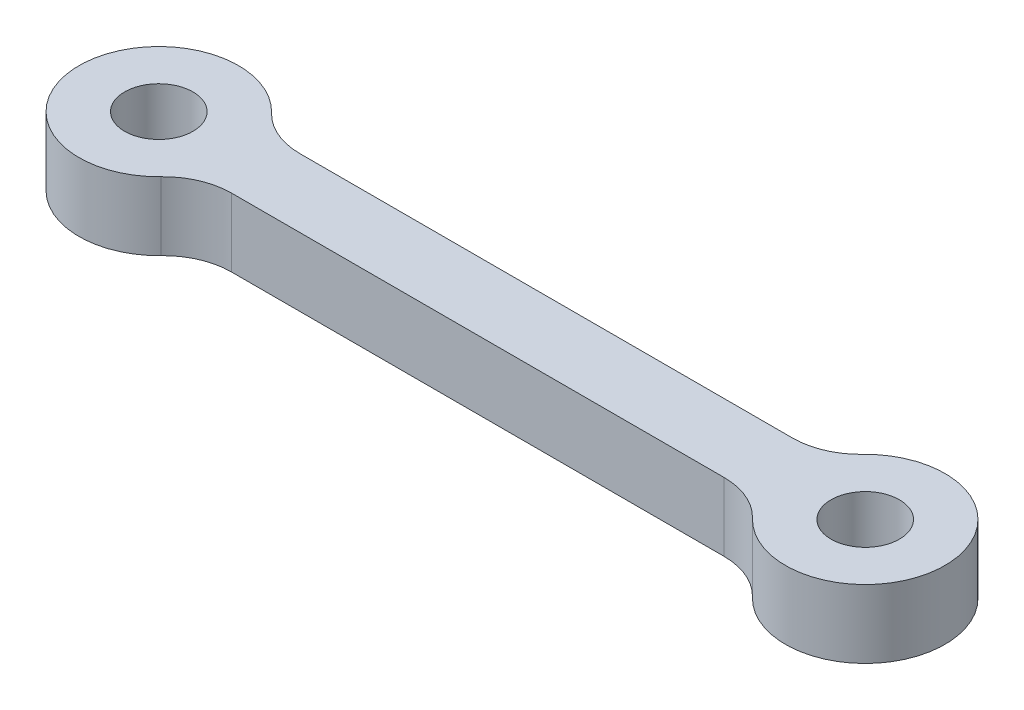
ISO-10303-21;
HEADER;
FILE_DESCRIPTION(('STEP AP214'),'2;1');
FILE_NAME('part.step','',(''),(''),'','','');
FILE_SCHEMA(('AUTOMOTIVE_DESIGN { 1 0 10303 214 1 1 1 1 }'));
ENDSEC;
DATA;
#1=APPLICATION_CONTEXT('core data for automotive mechanical design processes');
#2=APPLICATION_PROTOCOL_DEFINITION('international standard','automotive_design',2000,#1);
#3=PRODUCT_CONTEXT('',#1,'mechanical');
#4=PRODUCT('Part','Part','',(#3));
#5=PRODUCT_RELATED_PRODUCT_CATEGORY('part','',(#4));
#6=PRODUCT_DEFINITION_FORMATION('','',#4);
#7=PRODUCT_DEFINITION_CONTEXT('part definition',#1,'design');
#8=PRODUCT_DEFINITION('design','',#6,#7);
#9=PRODUCT_DEFINITION_SHAPE('','',#8);
#10=(LENGTH_UNIT() NAMED_UNIT(*) SI_UNIT(.MILLI.,.METRE.));
#11=(NAMED_UNIT(*) PLANE_ANGLE_UNIT() SI_UNIT($,.RADIAN.));
#12=(NAMED_UNIT(*) SI_UNIT($,.STERADIAN.) SOLID_ANGLE_UNIT());
#13=UNCERTAINTY_MEASURE_WITH_UNIT(LENGTH_MEASURE(1.E-05),#10,'distance_accuracy_value','');
#14=(GEOMETRIC_REPRESENTATION_CONTEXT(3) GLOBAL_UNCERTAINTY_ASSIGNED_CONTEXT((#13)) GLOBAL_UNIT_ASSIGNED_CONTEXT((#10,
#11,#12)) REPRESENTATION_CONTEXT('',''));
#15=CARTESIAN_POINT('',(0.,0.,0.));
#16=DIRECTION('',(0.,0.,1.));
#17=DIRECTION('',(1.,0.,0.));
#18=AXIS2_PLACEMENT_3D('',#15,#16,#17);
#19=CARTESIAN_POINT('',(-15.5,3.,0.));
#20=DIRECTION('',(0.,1.,0.));
#21=DIRECTION('',(0.,0.,1.));
#22=AXIS2_PLACEMENT_3D('',#19,#20,#21);
#23=PLANE('',#22);
#24=CARTESIAN_POINT('',(-15.5,3.,0.));
#25=DIRECTION('',(0.,1.,0.));
#26=DIRECTION('',(0.,0.,1.));
#27=AXIS2_PLACEMENT_3D('',#24,#25,#26);
#28=CIRCLE('',#27,1.5);
#29=CARTESIAN_POINT('',(-15.5,3.,1.5));
#30=VERTEX_POINT('',#29);
#31=EDGE_CURVE('E190',#30,#30,#28,.T.);
#32=ORIENTED_EDGE('',*,*,#31,.F.);
#33=EDGE_LOOP('',(#32));
#34=FACE_BOUND('',#33,.T.);
#35=DIRECTION('',(-1.,0.,0.));
#36=VECTOR('',#35,1.);
#37=CARTESIAN_POINT('',(-12.3377223398316,3.,-1.5));
#38=LINE('',#37,#36);
#39=CARTESIAN_POINT('',(10.8095842401766,3.,-1.5));
#40=VERTEX_POINT('',#39);
#41=CARTESIAN_POINT('',(-10.8095842401766,3.,-1.5));
#42=VERTEX_POINT('',#41);
#43=EDGE_CURVE('E125',#40,#42,#38,.T.);
#44=ORIENTED_EDGE('',*,*,#43,.T.);
#45=CARTESIAN_POINT('',(-10.8095842401766,3.,-4.5));
#46=DIRECTION('',(0.,1.,0.));
#47=DIRECTION('',(0.,0.,1.));
#48=AXIS2_PLACEMENT_3D('',#45,#46,#47);
#49=CIRCLE('',#48,3.);
#50=CARTESIAN_POINT('',(-12.9743915139412,3.,-2.42307692307692));
#51=VERTEX_POINT('',#50);
#52=EDGE_CURVE('E170',#42,#51,#49,.F.);
#53=ORIENTED_EDGE('',*,*,#52,.T.);
#54=CARTESIAN_POINT('',(-15.5,3.,0.));
#55=DIRECTION('',(0.,1.,0.));
#56=DIRECTION('',(0.,0.,1.));
#57=AXIS2_PLACEMENT_3D('',#54,#55,#56);
#58=CIRCLE('',#57,3.5);
#59=CARTESIAN_POINT('',(-12.9743915139412,3.,2.42307692307692));
#60=VERTEX_POINT('',#59);
#61=EDGE_CURVE('E135',#51,#60,#58,.T.);
#62=ORIENTED_EDGE('',*,*,#61,.T.);
#63=CARTESIAN_POINT('',(-10.8095842401766,3.,4.5));
#64=DIRECTION('',(0.,1.,0.));
#65=DIRECTION('',(0.,0.,1.));
#66=AXIS2_PLACEMENT_3D('',#63,#64,#65);
#67=CIRCLE('',#66,3.);
#68=CARTESIAN_POINT('',(-10.8095842401766,3.,1.5));
#69=VERTEX_POINT('',#68);
#70=EDGE_CURVE('E11',#60,#69,#67,.F.);
#71=ORIENTED_EDGE('',*,*,#70,.T.);
#72=DIRECTION('',(1.,0.,0.));
#73=VECTOR('',#72,1.);
#74=CARTESIAN_POINT('',(-12.3377223398316,3.,1.5));
#75=LINE('',#74,#73);
#76=CARTESIAN_POINT('',(10.8095842401766,3.,1.5));
#77=VERTEX_POINT('',#76);
#78=EDGE_CURVE('E140',#69,#77,#75,.T.);
#79=ORIENTED_EDGE('',*,*,#78,.T.);
#80=CARTESIAN_POINT('',(10.8095842401766,3.,4.5));
#81=DIRECTION('',(0.,1.,0.));
#82=DIRECTION('',(0.,0.,1.));
#83=AXIS2_PLACEMENT_3D('',#80,#81,#82);
#84=CIRCLE('',#83,3.);
#85=CARTESIAN_POINT('',(12.9743915139412,3.,2.42307692307692));
#86=VERTEX_POINT('',#85);
#87=EDGE_CURVE('E176',#77,#86,#84,.F.);
#88=ORIENTED_EDGE('',*,*,#87,.T.);
#89=CARTESIAN_POINT('',(15.5,3.,0.));
#90=DIRECTION('',(0.,1.,0.));
#91=DIRECTION('',(0.,0.,-1.));
#92=AXIS2_PLACEMENT_3D('',#89,#90,#91);
#93=CIRCLE('',#92,3.5);
#94=CARTESIAN_POINT('',(12.9743915139412,3.,-2.42307692307692));
#95=VERTEX_POINT('',#94);
#96=EDGE_CURVE('E195',#86,#95,#93,.T.);
#97=ORIENTED_EDGE('',*,*,#96,.T.);
#98=CARTESIAN_POINT('',(10.8095842401766,3.,-4.5));
#99=DIRECTION('',(0.,1.,0.));
#100=DIRECTION('',(0.,0.,1.));
#101=AXIS2_PLACEMENT_3D('',#98,#99,#100);
#102=CIRCLE('',#101,3.);
#103=EDGE_CURVE('E116',#95,#40,#102,.F.);
#104=ORIENTED_EDGE('',*,*,#103,.T.);
#105=EDGE_LOOP('',(#44,#53,#62,#71,#79,#88,#97,#104));
#106=FACE_BOUND('',#105,.T.);
#107=CARTESIAN_POINT('',(15.5,3.,0.));
#108=DIRECTION('',(0.,1.,0.));
#109=DIRECTION('',(0.,0.,1.));
#110=AXIS2_PLACEMENT_3D('',#107,#108,#109);
#111=CIRCLE('',#110,1.5);
#112=CARTESIAN_POINT('',(15.5,3.,1.5));
#113=VERTEX_POINT('',#112);
#114=EDGE_CURVE('E211',#113,#113,#111,.T.);
#115=ORIENTED_EDGE('',*,*,#114,.F.);
#116=EDGE_LOOP('',(#115));
#117=FACE_BOUND('',#116,.T.);
#118=ADVANCED_FACE('F39',(#34,#106,#117),#23,.T.);
#119=CARTESIAN_POINT('',(-15.5,0.,0.));
#120=DIRECTION('',(0.,1.,0.));
#121=DIRECTION('',(0.,0.,1.));
#122=AXIS2_PLACEMENT_3D('',#119,#120,#121);
#123=PLANE('',#122);
#124=CARTESIAN_POINT('',(-15.5,0.,0.));
#125=DIRECTION('',(0.,1.,0.));
#126=DIRECTION('',(0.,0.,1.));
#127=AXIS2_PLACEMENT_3D('',#124,#125,#126);
#128=CIRCLE('',#127,3.5);
#129=CARTESIAN_POINT('',(-12.9743915139412,0.,-2.42307692307692));
#130=VERTEX_POINT('',#129);
#131=CARTESIAN_POINT('',(-12.9743915139412,0.,2.42307692307692));
#132=VERTEX_POINT('',#131);
#133=EDGE_CURVE('E181',#130,#132,#128,.T.);
#134=ORIENTED_EDGE('',*,*,#133,.F.);
#135=CARTESIAN_POINT('',(-10.8095842401766,0.,-4.5));
#136=DIRECTION('',(0.,1.,0.));
#137=DIRECTION('',(0.,0.,1.));
#138=AXIS2_PLACEMENT_3D('',#135,#136,#137);
#139=CIRCLE('',#138,3.);
#140=CARTESIAN_POINT('',(-10.8095842401766,0.,-1.5));
#141=VERTEX_POINT('',#140);
#142=EDGE_CURVE('E133',#130,#141,#139,.T.);
#143=ORIENTED_EDGE('',*,*,#142,.T.);
#144=DIRECTION('',(-1.,0.,0.));
#145=VECTOR('',#144,1.);
#146=CARTESIAN_POINT('',(-12.3377223398316,0.,-1.5));
#147=LINE('',#146,#145);
#148=CARTESIAN_POINT('',(10.8095842401766,0.,-1.5));
#149=VERTEX_POINT('',#148);
#150=EDGE_CURVE('E122',#149,#141,#147,.T.);
#151=ORIENTED_EDGE('',*,*,#150,.F.);
#152=CARTESIAN_POINT('',(10.8095842401766,0.,-4.5));
#153=DIRECTION('',(0.,1.,0.));
#154=DIRECTION('',(0.,0.,1.));
#155=AXIS2_PLACEMENT_3D('',#152,#153,#154);
#156=CIRCLE('',#155,3.);
#157=CARTESIAN_POINT('',(12.9743915139412,0.,-2.42307692307692));
#158=VERTEX_POINT('',#157);
#159=EDGE_CURVE('E105',#149,#158,#156,.T.);
#160=ORIENTED_EDGE('',*,*,#159,.T.);
#161=CARTESIAN_POINT('',(15.5,0.,0.));
#162=DIRECTION('',(0.,1.,0.));
#163=DIRECTION('',(0.,0.,-1.));
#164=AXIS2_PLACEMENT_3D('',#161,#162,#163);
#165=CIRCLE('',#164,3.5);
#166=CARTESIAN_POINT('',(12.9743915139412,0.,2.42307692307692));
#167=VERTEX_POINT('',#166);
#168=EDGE_CURVE('E136',#167,#158,#165,.T.);
#169=ORIENTED_EDGE('',*,*,#168,.F.);
#170=CARTESIAN_POINT('',(10.8095842401766,0.,4.5));
#171=DIRECTION('',(0.,1.,0.));
#172=DIRECTION('',(0.,0.,1.));
#173=AXIS2_PLACEMENT_3D('',#170,#171,#172);
#174=CIRCLE('',#173,3.);
#175=CARTESIAN_POINT('',(10.8095842401766,0.,1.5));
#176=VERTEX_POINT('',#175);
#177=EDGE_CURVE('E173',#167,#176,#174,.T.);
#178=ORIENTED_EDGE('',*,*,#177,.T.);
#179=DIRECTION('',(1.,0.,0.));
#180=VECTOR('',#179,1.);
#181=CARTESIAN_POINT('',(-12.3377223398316,0.,1.5));
#182=LINE('',#181,#180);
#183=CARTESIAN_POINT('',(-10.8095842401766,0.,1.5));
#184=VERTEX_POINT('',#183);
#185=EDGE_CURVE('E142',#184,#176,#182,.T.);
#186=ORIENTED_EDGE('',*,*,#185,.F.);
#187=CARTESIAN_POINT('',(-10.8095842401766,0.,4.5));
#188=DIRECTION('',(0.,1.,0.));
#189=DIRECTION('',(0.,0.,1.));
#190=AXIS2_PLACEMENT_3D('',#187,#188,#189);
#191=CIRCLE('',#190,3.);
#192=EDGE_CURVE('E48',#184,#132,#191,.T.);
#193=ORIENTED_EDGE('',*,*,#192,.T.);
#194=EDGE_LOOP('',(#134,#143,#151,#160,#169,#178,#186,#193));
#195=FACE_BOUND('',#194,.T.);
#196=CARTESIAN_POINT('',(-15.5,0.,0.));
#197=DIRECTION('',(0.,1.,0.));
#198=DIRECTION('',(0.,0.,1.));
#199=AXIS2_PLACEMENT_3D('',#196,#197,#198);
#200=CIRCLE('',#199,1.5);
#201=CARTESIAN_POINT('',(-15.5,0.,1.5));
#202=VERTEX_POINT('',#201);
#203=EDGE_CURVE('E207',#202,#202,#200,.T.);
#204=ORIENTED_EDGE('',*,*,#203,.T.);
#205=EDGE_LOOP('',(#204));
#206=FACE_BOUND('',#205,.T.);
#207=CARTESIAN_POINT('',(15.5,0.,0.));
#208=DIRECTION('',(0.,1.,0.));
#209=DIRECTION('',(0.,0.,1.));
#210=AXIS2_PLACEMENT_3D('',#207,#208,#209);
#211=CIRCLE('',#210,1.5);
#212=CARTESIAN_POINT('',(15.5,0.,1.5));
#213=VERTEX_POINT('',#212);
#214=EDGE_CURVE('E214',#213,#213,#211,.T.);
#215=ORIENTED_EDGE('',*,*,#214,.T.);
#216=EDGE_LOOP('',(#215));
#217=FACE_BOUND('',#216,.T.);
#218=ADVANCED_FACE('F131',(#195,#206,#217),#123,.F.);
#219=CARTESIAN_POINT('',(-15.5,3.,0.));
#220=DIRECTION('',(0.,-1.,0.));
#221=DIRECTION('',(0.,0.,-1.));
#222=AXIS2_PLACEMENT_3D('',#219,#220,#221);
#223=CYLINDRICAL_SURFACE('',#222,3.5);
#224=ORIENTED_EDGE('',*,*,#61,.F.);
#225=DIRECTION('',(0.,-1.,0.));
#226=VECTOR('',#225,1.);
#227=CARTESIAN_POINT('',(-12.9743915139412,3.,-2.42307692307692));
#228=LINE('',#227,#226);
#229=EDGE_CURVE('E156',#51,#130,#228,.T.);
#230=ORIENTED_EDGE('',*,*,#229,.T.);
#231=ORIENTED_EDGE('',*,*,#133,.T.);
#232=DIRECTION('',(0.,-1.,0.));
#233=VECTOR('',#232,1.);
#234=CARTESIAN_POINT('',(-12.9743915139412,3.,2.42307692307692));
#235=LINE('',#234,#233);
#236=EDGE_CURVE('E153',#132,#60,#235,.F.);
#237=ORIENTED_EDGE('',*,*,#236,.T.);
#238=EDGE_LOOP('',(#224,#230,#231,#237));
#239=FACE_BOUND('',#238,.T.);
#240=ADVANCED_FACE('F187',(#239),#223,.T.);
#241=CARTESIAN_POINT('',(-12.3377223398316,3.,1.5));
#242=DIRECTION('',(0.,0.,-1.));
#243=DIRECTION('',(-1.,0.,0.));
#244=AXIS2_PLACEMENT_3D('',#241,#242,#243);
#245=PLANE('',#244);
#246=ORIENTED_EDGE('',*,*,#185,.T.);
#247=DIRECTION('',(0.,1.,0.));
#248=VECTOR('',#247,1.);
#249=CARTESIAN_POINT('',(10.8095842401766,3.,1.5));
#250=LINE('',#249,#248);
#251=EDGE_CURVE('E55',#176,#77,#250,.T.);
#252=ORIENTED_EDGE('',*,*,#251,.T.);
#253=ORIENTED_EDGE('',*,*,#78,.F.);
#254=DIRECTION('',(0.,1.,0.));
#255=VECTOR('',#254,1.);
#256=CARTESIAN_POINT('',(-10.8095842401766,0.,1.5));
#257=LINE('',#256,#255);
#258=EDGE_CURVE('E160',#69,#184,#257,.F.);
#259=ORIENTED_EDGE('',*,*,#258,.T.);
#260=EDGE_LOOP('',(#246,#252,#253,#259));
#261=FACE_BOUND('',#260,.T.);
#262=ADVANCED_FACE('F192',(#261),#245,.F.);
#263=CARTESIAN_POINT('',(15.5,3.,0.));
#264=DIRECTION('',(0.,-1.,0.));
#265=DIRECTION('',(0.,0.,-1.));
#266=AXIS2_PLACEMENT_3D('',#263,#264,#265);
#267=CYLINDRICAL_SURFACE('',#266,3.5);
#268=ORIENTED_EDGE('',*,*,#168,.T.);
#269=DIRECTION('',(0.,-1.,0.));
#270=VECTOR('',#269,1.);
#271=CARTESIAN_POINT('',(12.9743915139412,3.,-2.42307692307692));
#272=LINE('',#271,#270);
#273=EDGE_CURVE('E110',#158,#95,#272,.F.);
#274=ORIENTED_EDGE('',*,*,#273,.T.);
#275=ORIENTED_EDGE('',*,*,#96,.F.);
#276=DIRECTION('',(0.,-1.,0.));
#277=VECTOR('',#276,1.);
#278=CARTESIAN_POINT('',(12.9743915139412,3.,2.42307692307692));
#279=LINE('',#278,#277);
#280=EDGE_CURVE('E127',#86,#167,#279,.T.);
#281=ORIENTED_EDGE('',*,*,#280,.T.);
#282=EDGE_LOOP('',(#268,#274,#275,#281));
#283=FACE_BOUND('',#282,.T.);
#284=ADVANCED_FACE('F245',(#283),#267,.T.);
#285=CARTESIAN_POINT('',(-12.3377223398316,3.,-1.5));
#286=DIRECTION('',(0.,0.,1.));
#287=DIRECTION('',(1.,0.,0.));
#288=AXIS2_PLACEMENT_3D('',#285,#286,#287);
#289=PLANE('',#288);
#290=ORIENTED_EDGE('',*,*,#43,.F.);
#291=DIRECTION('',(0.,1.,0.));
#292=VECTOR('',#291,1.);
#293=CARTESIAN_POINT('',(10.8095842401766,0.,-1.5));
#294=LINE('',#293,#292);
#295=EDGE_CURVE('E109',#40,#149,#294,.F.);
#296=ORIENTED_EDGE('',*,*,#295,.T.);
#297=ORIENTED_EDGE('',*,*,#150,.T.);
#298=DIRECTION('',(0.,1.,0.));
#299=VECTOR('',#298,1.);
#300=CARTESIAN_POINT('',(-10.8095842401766,3.,-1.5));
#301=LINE('',#300,#299);
#302=EDGE_CURVE('E128',#141,#42,#301,.T.);
#303=ORIENTED_EDGE('',*,*,#302,.T.);
#304=EDGE_LOOP('',(#290,#296,#297,#303));
#305=FACE_BOUND('',#304,.T.);
#306=ADVANCED_FACE('F121',(#305),#289,.F.);
#307=CARTESIAN_POINT('',(-15.5,3.,0.));
#308=DIRECTION('',(0.,-1.,0.));
#309=DIRECTION('',(0.,0.,-1.));
#310=AXIS2_PLACEMENT_3D('',#307,#308,#309);
#311=CYLINDRICAL_SURFACE('',#310,1.5);
#312=ORIENTED_EDGE('',*,*,#31,.T.);
#313=EDGE_LOOP('',(#312));
#314=FACE_BOUND('',#313,.T.);
#315=ORIENTED_EDGE('',*,*,#203,.F.);
#316=EDGE_LOOP('',(#315));
#317=FACE_BOUND('',#316,.T.);
#318=ADVANCED_FACE('F223',(#314,#317),#311,.F.);
#319=CARTESIAN_POINT('',(15.5,3.,0.));
#320=DIRECTION('',(0.,-1.,0.));
#321=DIRECTION('',(0.,0.,-1.));
#322=AXIS2_PLACEMENT_3D('',#319,#320,#321);
#323=CYLINDRICAL_SURFACE('',#322,1.5);
#324=ORIENTED_EDGE('',*,*,#114,.T.);
#325=EDGE_LOOP('',(#324));
#326=FACE_BOUND('',#325,.T.);
#327=ORIENTED_EDGE('',*,*,#214,.F.);
#328=EDGE_LOOP('',(#327));
#329=FACE_BOUND('',#328,.T.);
#330=ADVANCED_FACE('F221',(#326,#329),#323,.F.);
#331=CARTESIAN_POINT('',(10.8095842401766,3.,-4.5));
#332=DIRECTION('',(0.,-1.,0.));
#333=DIRECTION('',(0.,0.,-1.));
#334=AXIS2_PLACEMENT_3D('',#331,#332,#333);
#335=CYLINDRICAL_SURFACE('',#334,3.);
#336=ORIENTED_EDGE('',*,*,#103,.F.);
#337=ORIENTED_EDGE('',*,*,#273,.F.);
#338=ORIENTED_EDGE('',*,*,#159,.F.);
#339=ORIENTED_EDGE('',*,*,#295,.F.);
#340=EDGE_LOOP('',(#336,#337,#338,#339));
#341=FACE_BOUND('',#340,.T.);
#342=ADVANCED_FACE('F108',(#341),#335,.F.);
#343=CARTESIAN_POINT('',(-10.8095842401766,3.,-4.5));
#344=DIRECTION('',(0.,-1.,0.));
#345=DIRECTION('',(0.,0.,-1.));
#346=AXIS2_PLACEMENT_3D('',#343,#344,#345);
#347=CYLINDRICAL_SURFACE('',#346,3.);
#348=ORIENTED_EDGE('',*,*,#52,.F.);
#349=ORIENTED_EDGE('',*,*,#302,.F.);
#350=ORIENTED_EDGE('',*,*,#142,.F.);
#351=ORIENTED_EDGE('',*,*,#229,.F.);
#352=EDGE_LOOP('',(#348,#349,#350,#351));
#353=FACE_BOUND('',#352,.T.);
#354=ADVANCED_FACE('F230',(#353),#347,.F.);
#355=CARTESIAN_POINT('',(10.8095842401766,3.,4.5));
#356=DIRECTION('',(0.,-1.,0.));
#357=DIRECTION('',(0.,0.,-1.));
#358=AXIS2_PLACEMENT_3D('',#355,#356,#357);
#359=CYLINDRICAL_SURFACE('',#358,3.);
#360=ORIENTED_EDGE('',*,*,#87,.F.);
#361=ORIENTED_EDGE('',*,*,#251,.F.);
#362=ORIENTED_EDGE('',*,*,#177,.F.);
#363=ORIENTED_EDGE('',*,*,#280,.F.);
#364=EDGE_LOOP('',(#360,#361,#362,#363));
#365=FACE_BOUND('',#364,.T.);
#366=ADVANCED_FACE('F254',(#365),#359,.F.);
#367=CARTESIAN_POINT('',(-10.8095842401766,3.,4.5));
#368=DIRECTION('',(0.,-1.,0.));
#369=DIRECTION('',(0.,0.,-1.));
#370=AXIS2_PLACEMENT_3D('',#367,#368,#369);
#371=CYLINDRICAL_SURFACE('',#370,3.);
#372=ORIENTED_EDGE('',*,*,#70,.F.);
#373=ORIENTED_EDGE('',*,*,#236,.F.);
#374=ORIENTED_EDGE('',*,*,#192,.F.);
#375=ORIENTED_EDGE('',*,*,#258,.F.);
#376=EDGE_LOOP('',(#372,#373,#374,#375));
#377=FACE_BOUND('',#376,.T.);
#378=ADVANCED_FACE('F41',(#377),#371,.F.);
#379=CLOSED_SHELL('',(#118,#218,#240,#262,#284,#306,#318,#330,#342,#354,#366,#378));
#380=MANIFOLD_SOLID_BREP('B2',#379);
#381=ADVANCED_BREP_SHAPE_REPRESENTATION('',(#18,#380),#14);
#382=SHAPE_DEFINITION_REPRESENTATION(#9,#381);
ENDSEC;
END-ISO-10303-21;
